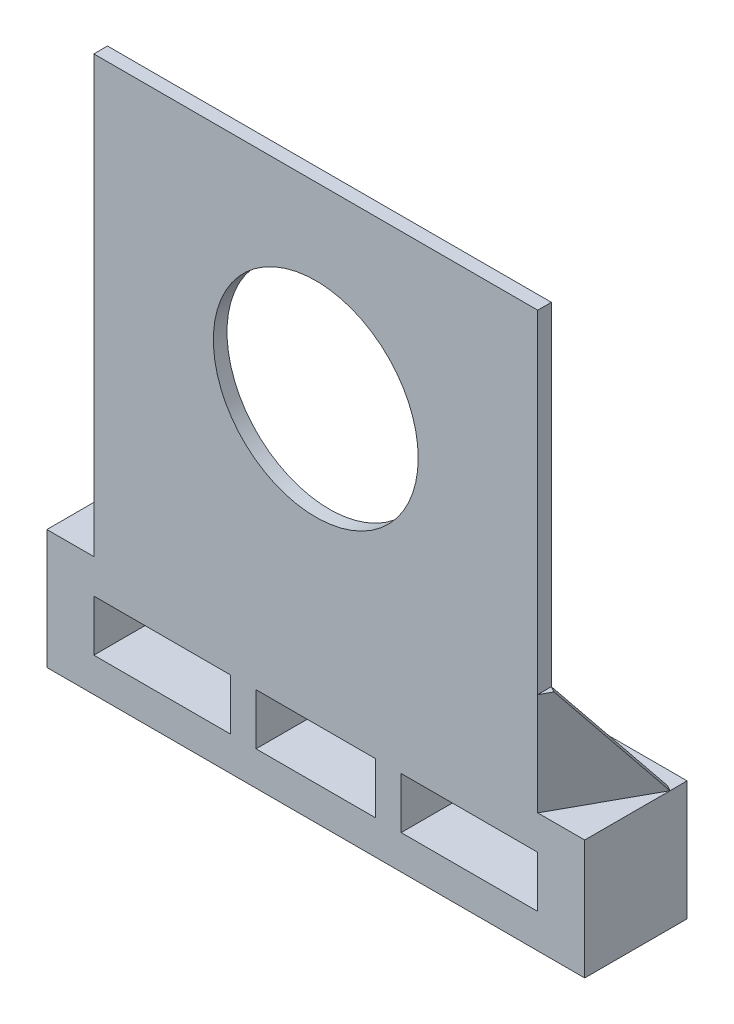
ISO-10303-21;
HEADER;
FILE_DESCRIPTION(('STEP AP214'),'2;1');
FILE_NAME('part.step','',(''),(''),'','','');
FILE_SCHEMA(('AUTOMOTIVE_DESIGN { 1 0 10303 214 1 1 1 1 }'));
ENDSEC;
DATA;
#1=APPLICATION_CONTEXT('core data for automotive mechanical design processes');
#2=APPLICATION_PROTOCOL_DEFINITION('international standard','automotive_design',2000,#1);
#3=PRODUCT_CONTEXT('',#1,'mechanical');
#4=PRODUCT('Part','Part','',(#3));
#5=PRODUCT_RELATED_PRODUCT_CATEGORY('part','',(#4));
#6=PRODUCT_DEFINITION_FORMATION('','',#4);
#7=PRODUCT_DEFINITION_CONTEXT('part definition',#1,'design');
#8=PRODUCT_DEFINITION('design','',#6,#7);
#9=PRODUCT_DEFINITION_SHAPE('','',#8);
#10=(LENGTH_UNIT() NAMED_UNIT(*) SI_UNIT(.MILLI.,.METRE.));
#11=(NAMED_UNIT(*) PLANE_ANGLE_UNIT() SI_UNIT($,.RADIAN.));
#12=(NAMED_UNIT(*) SI_UNIT($,.STERADIAN.) SOLID_ANGLE_UNIT());
#13=UNCERTAINTY_MEASURE_WITH_UNIT(LENGTH_MEASURE(1.E-05),#10,'distance_accuracy_value','');
#14=(GEOMETRIC_REPRESENTATION_CONTEXT(3) GLOBAL_UNCERTAINTY_ASSIGNED_CONTEXT((#13)) GLOBAL_UNIT_ASSIGNED_CONTEXT((#10,
#11,#12)) REPRESENTATION_CONTEXT('',''));
#15=CARTESIAN_POINT('',(0.,0.,0.));
#16=DIRECTION('',(0.,0.,1.));
#17=DIRECTION('',(1.,0.,0.));
#18=AXIS2_PLACEMENT_3D('',#15,#16,#17);
#19=CARTESIAN_POINT('',(287.5,0.,-52.));
#20=DIRECTION('',(0.,1.,0.));
#21=DIRECTION('',(-1.,0.,0.));
#22=AXIS2_PLACEMENT_3D('',#19,#20,#21);
#23=PLANE('',#22);
#24=DIRECTION('',(-0.87621590867665,0.,0.48191874977215));
#25=VECTOR('',#24,1.);
#26=CARTESIAN_POINT('',(-27.4999999999996,0.,-42.));
#27=LINE('',#26,#25);
#28=CARTESIAN_POINT('',(-24.1218809980803,0.,-43.8579654510556));
#29=VERTEX_POINT('',#28);
#30=CARTESIAN_POINT('',(-27.4999999999996,0.,-42.));
#31=VERTEX_POINT('',#30);
#32=EDGE_CURVE('E206',#29,#31,#27,.T.);
#33=ORIENTED_EDGE('',*,*,#32,.F.);
#34=DIRECTION('',(-0.481918749772151,0.,-0.87621590867665));
#35=VECTOR('',#34,1.);
#36=CARTESIAN_POINT('',(-24.1218809980803,0.,-43.8579654510556));
#37=LINE('',#36,#35);
#38=CARTESIAN_POINT('',(0.,0.,0.));
#39=VERTEX_POINT('',#38);
#40=EDGE_CURVE('E212',#39,#29,#37,.T.);
#41=ORIENTED_EDGE('',*,*,#40,.F.);
#42=DIRECTION('',(1.,0.,0.));
#43=VECTOR('',#42,1.);
#44=CARTESIAN_POINT('',(260.,0.,0.));
#45=LINE('',#44,#43);
#46=CARTESIAN_POINT('',(260.,0.,0.));
#47=VERTEX_POINT('',#46);
#48=EDGE_CURVE('E393',#39,#47,#45,.T.);
#49=ORIENTED_EDGE('',*,*,#48,.T.);
#50=DIRECTION('',(-0.48191874977216,0.,0.876215908676645));
#51=VECTOR('',#50,1.);
#52=CARTESIAN_POINT('',(284.121880998081,0.,-43.8579654510557));
#53=LINE('',#52,#51);
#54=CARTESIAN_POINT('',(284.121880998081,0.,-43.8579654510557));
#55=VERTEX_POINT('',#54);
#56=EDGE_CURVE('E237',#55,#47,#53,.T.);
#57=ORIENTED_EDGE('',*,*,#56,.F.);
#58=DIRECTION('',(-0.876215908676644,0.,-0.481918749772161));
#59=VECTOR('',#58,1.);
#60=CARTESIAN_POINT('',(287.5,0.,-42.));
#61=LINE('',#60,#59);
#62=CARTESIAN_POINT('',(287.5,0.,-42.));
#63=VERTEX_POINT('',#62);
#64=EDGE_CURVE('E241',#63,#55,#61,.T.);
#65=ORIENTED_EDGE('',*,*,#64,.F.);
#66=DIRECTION('',(0.,0.,1.));
#67=VECTOR('',#66,1.);
#68=CARTESIAN_POINT('',(287.5,0.,-52.));
#69=LINE('',#68,#67);
#70=CARTESIAN_POINT('',(287.5,0.,-52.));
#71=VERTEX_POINT('',#70);
#72=EDGE_CURVE('E371',#71,#63,#69,.T.);
#73=ORIENTED_EDGE('',*,*,#72,.F.);
#74=DIRECTION('',(-1.,0.,0.));
#75=VECTOR('',#74,1.);
#76=CARTESIAN_POINT('',(287.5,0.,-52.));
#77=LINE('',#76,#75);
#78=CARTESIAN_POINT('',(-27.4999999999996,0.,-52.));
#79=VERTEX_POINT('',#78);
#80=EDGE_CURVE('E347',#71,#79,#77,.T.);
#81=ORIENTED_EDGE('',*,*,#80,.T.);
#82=DIRECTION('',(0.,0.,1.));
#83=VECTOR('',#82,1.);
#84=CARTESIAN_POINT('',(-27.4999999999996,0.,-52.));
#85=LINE('',#84,#83);
#86=EDGE_CURVE('E223',#79,#31,#85,.T.);
#87=ORIENTED_EDGE('',*,*,#86,.T.);
#88=EDGE_LOOP('',(#33,#41,#49,#57,#65,#73,#81,#87));
#89=FACE_BOUND('',#88,.T.);
#90=ADVANCED_FACE('F34',(#89),#23,.T.);
#91=DIRECTION('',(-1.,0.,0.));
#92=VECTOR('',#91,1.);
#93=CARTESIAN_POINT('',(287.5,0.,8.));
#94=LINE('',#93,#92);
#95=CARTESIAN_POINT('',(0.,0.,8.));
#96=VERTEX_POINT('',#95);
#97=CARTESIAN_POINT('',(-27.4999999999996,0.,8.));
#98=VERTEX_POINT('',#97);
#99=EDGE_CURVE('E358',#96,#98,#94,.T.);
#100=ORIENTED_EDGE('',*,*,#99,.F.);
#101=DIRECTION('',(0.481918749772151,0.,0.87621590867665));
#102=VECTOR('',#101,1.);
#103=CARTESIAN_POINT('',(0.,0.,8.));
#104=LINE('',#103,#102);
#105=EDGE_CURVE('E224',#31,#96,#104,.T.);
#106=ORIENTED_EDGE('',*,*,#105,.F.);
#107=EDGE_CURVE('E374',#31,#98,#85,.T.);
#108=ORIENTED_EDGE('',*,*,#107,.T.);
#109=EDGE_LOOP('',(#100,#106,#108));
#110=FACE_BOUND('',#109,.T.);
#111=ADVANCED_FACE('F484',(#110),#23,.T.);
#112=CARTESIAN_POINT('',(287.5,0.,8.));
#113=VERTEX_POINT('',#112);
#114=EDGE_CURVE('E370',#63,#113,#69,.T.);
#115=ORIENTED_EDGE('',*,*,#114,.F.);
#116=DIRECTION('',(0.481918749772161,0.,-0.876215908676644));
#117=VECTOR('',#116,1.);
#118=CARTESIAN_POINT('',(260.,0.,8.));
#119=LINE('',#118,#117);
#120=CARTESIAN_POINT('',(260.,0.,8.));
#121=VERTEX_POINT('',#120);
#122=EDGE_CURVE('E231',#121,#63,#119,.T.);
#123=ORIENTED_EDGE('',*,*,#122,.F.);
#124=EDGE_CURVE('E366',#113,#121,#94,.T.);
#125=ORIENTED_EDGE('',*,*,#124,.F.);
#126=EDGE_LOOP('',(#115,#123,#125));
#127=FACE_BOUND('',#126,.T.);
#128=ADVANCED_FACE('F470',(#127),#23,.T.);
#129=CARTESIAN_POINT('',(0.,0.,8.));
#130=DIRECTION('',(0.,0.,-1.));
#131=DIRECTION('',(-1.,0.,0.));
#132=AXIS2_PLACEMENT_3D('',#129,#130,#131);
#133=PLANE('',#132);
#134=DIRECTION('',(0.,-1.,0.));
#135=VECTOR('',#134,1.);
#136=CARTESIAN_POINT('',(0.,255.,8.));
#137=LINE('',#136,#135);
#138=CARTESIAN_POINT('',(0.,255.,8.));
#139=VERTEX_POINT('',#138);
#140=CARTESIAN_POINT('',(0.,60.,8.));
#141=VERTEX_POINT('',#140);
#142=EDGE_CURVE('E401',#139,#141,#137,.T.);
#143=ORIENTED_EDGE('',*,*,#142,.T.);
#144=DIRECTION('',(0.,-1.,0.));
#145=VECTOR('',#144,1.);
#146=CARTESIAN_POINT('',(0.,60.,8.));
#147=LINE('',#146,#145);
#148=EDGE_CURVE('E232',#141,#96,#147,.T.);
#149=ORIENTED_EDGE('',*,*,#148,.T.);
#150=ORIENTED_EDGE('',*,*,#99,.T.);
#151=DIRECTION('',(0.,-1.,0.));
#152=VECTOR('',#151,1.);
#153=CARTESIAN_POINT('',(-27.4999999999996,0.,8.));
#154=LINE('',#153,#152);
#155=CARTESIAN_POINT('',(-27.4999999999996,-70.,8.));
#156=VERTEX_POINT('',#155);
#157=EDGE_CURVE('E344',#98,#156,#154,.T.);
#158=ORIENTED_EDGE('',*,*,#157,.T.);
#159=DIRECTION('',(1.,0.,0.));
#160=VECTOR('',#159,1.);
#161=CARTESIAN_POINT('',(-27.4999999999996,-70.,8.));
#162=LINE('',#161,#160);
#163=CARTESIAN_POINT('',(287.5,-69.9999999999999,8.));
#164=VERTEX_POINT('',#163);
#165=EDGE_CURVE('E333',#156,#164,#162,.T.);
#166=ORIENTED_EDGE('',*,*,#165,.T.);
#167=DIRECTION('',(0.,1.,0.));
#168=VECTOR('',#167,1.);
#169=CARTESIAN_POINT('',(287.5,-69.9999999999999,8.));
#170=LINE('',#169,#168);
#171=EDGE_CURVE('E355',#164,#113,#170,.T.);
#172=ORIENTED_EDGE('',*,*,#171,.T.);
#173=ORIENTED_EDGE('',*,*,#124,.T.);
#174=DIRECTION('',(0.,1.,0.));
#175=VECTOR('',#174,1.);
#176=CARTESIAN_POINT('',(260.,0.,8.));
#177=LINE('',#176,#175);
#178=CARTESIAN_POINT('',(260.,60.,8.));
#179=VERTEX_POINT('',#178);
#180=EDGE_CURVE('E390',#121,#179,#177,.T.);
#181=ORIENTED_EDGE('',*,*,#180,.T.);
#182=CARTESIAN_POINT('',(260.,255.,8.));
#183=VERTEX_POINT('',#182);
#184=EDGE_CURVE('E406',#179,#183,#177,.T.);
#185=ORIENTED_EDGE('',*,*,#184,.T.);
#186=DIRECTION('',(-1.,0.,0.));
#187=VECTOR('',#186,1.);
#188=CARTESIAN_POINT('',(260.,255.,8.));
#189=LINE('',#188,#187);
#190=EDGE_CURVE('E388',#183,#139,#189,.T.);
#191=ORIENTED_EDGE('',*,*,#190,.T.);
#192=EDGE_LOOP('',(#143,#149,#150,#158,#166,#172,#173,#181,#185,#191));
#193=FACE_BOUND('',#192,.T.);
#194=CARTESIAN_POINT('',(130.,145.,8.));
#195=DIRECTION('',(0.,0.,1.));
#196=DIRECTION('',(1.,0.,0.));
#197=AXIS2_PLACEMENT_3D('',#194,#195,#196);
#198=CIRCLE('',#197,60.);
#199=CARTESIAN_POINT('',(190.,145.,8.));
#200=VERTEX_POINT('',#199);
#201=EDGE_CURVE('E381',#200,#200,#198,.T.);
#202=ORIENTED_EDGE('',*,*,#201,.F.);
#203=EDGE_LOOP('',(#202));
#204=FACE_BOUND('',#203,.T.);
#205=DIRECTION('',(-1.,0.,0.));
#206=VECTOR('',#205,1.);
#207=CARTESIAN_POINT('',(0.,-20.,8.));
#208=LINE('',#207,#206);
#209=CARTESIAN_POINT('',(79.9999999999999,-20.,8.));
#210=VERTEX_POINT('',#209);
#211=CARTESIAN_POINT('',(-1.11022302462516E-13,-20.,8.));
#212=VERTEX_POINT('',#211);
#213=EDGE_CURVE('E240',#210,#212,#208,.T.);
#214=ORIENTED_EDGE('',*,*,#213,.F.);
#215=DIRECTION('',(0.,1.,0.));
#216=VECTOR('',#215,1.);
#217=CARTESIAN_POINT('',(79.9999999999999,-20.,8.));
#218=LINE('',#217,#216);
#219=CARTESIAN_POINT('',(79.9999999999999,-50.,8.));
#220=VERTEX_POINT('',#219);
#221=EDGE_CURVE('E248',#220,#210,#218,.T.);
#222=ORIENTED_EDGE('',*,*,#221,.F.);
#223=DIRECTION('',(1.,0.,0.));
#224=VECTOR('',#223,1.);
#225=CARTESIAN_POINT('',(0.,-50.,8.));
#226=LINE('',#225,#224);
#227=CARTESIAN_POINT('',(0.,-50.,8.));
#228=VERTEX_POINT('',#227);
#229=EDGE_CURVE('E262',#228,#220,#226,.T.);
#230=ORIENTED_EDGE('',*,*,#229,.F.);
#231=DIRECTION('',(0.,-1.,0.));
#232=VECTOR('',#231,1.);
#233=CARTESIAN_POINT('',(0.,-20.,8.));
#234=LINE('',#233,#232);
#235=EDGE_CURVE('E259',#212,#228,#234,.T.);
#236=ORIENTED_EDGE('',*,*,#235,.F.);
#237=EDGE_LOOP('',(#214,#222,#230,#236));
#238=FACE_BOUND('',#237,.T.);
#239=DIRECTION('',(-1.,0.,0.));
#240=VECTOR('',#239,1.);
#241=CARTESIAN_POINT('',(95.,-20.,8.));
#242=LINE('',#241,#240);
#243=CARTESIAN_POINT('',(165.,-20.,8.));
#244=VERTEX_POINT('',#243);
#245=CARTESIAN_POINT('',(95.,-20.,8.));
#246=VERTEX_POINT('',#245);
#247=EDGE_CURVE('E269',#244,#246,#242,.T.);
#248=ORIENTED_EDGE('',*,*,#247,.F.);
#249=DIRECTION('',(0.,1.,0.));
#250=VECTOR('',#249,1.);
#251=CARTESIAN_POINT('',(165.,-20.,8.));
#252=LINE('',#251,#250);
#253=CARTESIAN_POINT('',(165.,-50.,8.));
#254=VERTEX_POINT('',#253);
#255=EDGE_CURVE('E280',#254,#244,#252,.T.);
#256=ORIENTED_EDGE('',*,*,#255,.F.);
#257=DIRECTION('',(1.,0.,0.));
#258=VECTOR('',#257,1.);
#259=CARTESIAN_POINT('',(94.9999999999999,-50.,8.));
#260=LINE('',#259,#258);
#261=CARTESIAN_POINT('',(94.9999999999999,-50.,8.));
#262=VERTEX_POINT('',#261);
#263=EDGE_CURVE('E294',#262,#254,#260,.T.);
#264=ORIENTED_EDGE('',*,*,#263,.F.);
#265=DIRECTION('',(0.,-1.,0.));
#266=VECTOR('',#265,1.);
#267=CARTESIAN_POINT('',(94.9999999999999,-50.,8.));
#268=LINE('',#267,#266);
#269=EDGE_CURVE('E291',#246,#262,#268,.T.);
#270=ORIENTED_EDGE('',*,*,#269,.F.);
#271=EDGE_LOOP('',(#248,#256,#264,#270));
#272=FACE_BOUND('',#271,.T.);
#273=DIRECTION('',(1.,0.,0.));
#274=VECTOR('',#273,1.);
#275=CARTESIAN_POINT('',(180.000000000001,-50.,8.));
#276=LINE('',#275,#274);
#277=CARTESIAN_POINT('',(180.000000000001,-50.,8.));
#278=VERTEX_POINT('',#277);
#279=CARTESIAN_POINT('',(260.,-50.,8.));
#280=VERTEX_POINT('',#279);
#281=EDGE_CURVE('E301',#278,#280,#276,.T.);
#282=ORIENTED_EDGE('',*,*,#281,.F.);
#283=DIRECTION('',(0.,-1.,0.));
#284=VECTOR('',#283,1.);
#285=CARTESIAN_POINT('',(180.000000000001,-50.,8.));
#286=LINE('',#285,#284);
#287=CARTESIAN_POINT('',(180.000000000001,-20.,8.));
#288=VERTEX_POINT('',#287);
#289=EDGE_CURVE('E312',#288,#278,#286,.T.);
#290=ORIENTED_EDGE('',*,*,#289,.F.);
#291=DIRECTION('',(-1.,0.,0.));
#292=VECTOR('',#291,1.);
#293=CARTESIAN_POINT('',(180.000000000001,-20.,8.));
#294=LINE('',#293,#292);
#295=CARTESIAN_POINT('',(260.,-20.,8.));
#296=VERTEX_POINT('',#295);
#297=EDGE_CURVE('E326',#296,#288,#294,.T.);
#298=ORIENTED_EDGE('',*,*,#297,.F.);
#299=DIRECTION('',(0.,1.,0.));
#300=VECTOR('',#299,1.);
#301=CARTESIAN_POINT('',(260.,-50.,8.));
#302=LINE('',#301,#300);
#303=EDGE_CURVE('E323',#280,#296,#302,.T.);
#304=ORIENTED_EDGE('',*,*,#303,.F.);
#305=EDGE_LOOP('',(#282,#290,#298,#304));
#306=FACE_BOUND('',#305,.T.);
#307=ADVANCED_FACE('F439',(#193,#204,#238,#272,#306),#133,.F.);
#308=CARTESIAN_POINT('',(0.,0.,0.));
#309=DIRECTION('',(0.,0.,-1.));
#310=DIRECTION('',(-1.,0.,0.));
#311=AXIS2_PLACEMENT_3D('',#308,#309,#310);
#312=PLANE('',#311);
#313=DIRECTION('',(0.,-1.,0.));
#314=VECTOR('',#313,1.);
#315=CARTESIAN_POINT('',(0.,255.,0.));
#316=LINE('',#315,#314);
#317=CARTESIAN_POINT('',(0.,255.,0.));
#318=VERTEX_POINT('',#317);
#319=CARTESIAN_POINT('',(0.,60.,0.));
#320=VERTEX_POINT('',#319);
#321=EDGE_CURVE('E386',#318,#320,#316,.T.);
#322=ORIENTED_EDGE('',*,*,#321,.F.);
#323=DIRECTION('',(-1.,0.,0.));
#324=VECTOR('',#323,1.);
#325=CARTESIAN_POINT('',(260.,255.,0.));
#326=LINE('',#325,#324);
#327=CARTESIAN_POINT('',(260.,255.,0.));
#328=VERTEX_POINT('',#327);
#329=EDGE_CURVE('E399',#328,#318,#326,.T.);
#330=ORIENTED_EDGE('',*,*,#329,.F.);
#331=DIRECTION('',(0.,1.,0.));
#332=VECTOR('',#331,1.);
#333=CARTESIAN_POINT('',(260.,0.,0.));
#334=LINE('',#333,#332);
#335=CARTESIAN_POINT('',(260.,60.,0.));
#336=VERTEX_POINT('',#335);
#337=EDGE_CURVE('E395',#336,#328,#334,.T.);
#338=ORIENTED_EDGE('',*,*,#337,.F.);
#339=EDGE_CURVE('E396',#47,#336,#334,.T.);
#340=ORIENTED_EDGE('',*,*,#339,.F.);
#341=ORIENTED_EDGE('',*,*,#48,.F.);
#342=DIRECTION('',(0.,-1.,0.));
#343=VECTOR('',#342,1.);
#344=CARTESIAN_POINT('',(0.,60.,0.));
#345=LINE('',#344,#343);
#346=EDGE_CURVE('E215',#320,#39,#345,.T.);
#347=ORIENTED_EDGE('',*,*,#346,.F.);
#348=EDGE_LOOP('',(#322,#330,#338,#340,#341,#347));
#349=FACE_BOUND('',#348,.T.);
#350=CARTESIAN_POINT('',(130.,145.,0.));
#351=DIRECTION('',(0.,0.,1.));
#352=DIRECTION('',(1.,0.,0.));
#353=AXIS2_PLACEMENT_3D('',#350,#351,#352);
#354=CIRCLE('',#353,60.);
#355=CARTESIAN_POINT('',(190.,145.,0.));
#356=VERTEX_POINT('',#355);
#357=EDGE_CURVE('E376',#356,#356,#354,.T.);
#358=ORIENTED_EDGE('',*,*,#357,.T.);
#359=EDGE_LOOP('',(#358));
#360=FACE_BOUND('',#359,.T.);
#361=ADVANCED_FACE('F449',(#349,#360),#312,.T.);
#362=CARTESIAN_POINT('',(0.,255.,8.));
#363=DIRECTION('',(1.,0.,0.));
#364=DIRECTION('',(0.,1.,0.));
#365=AXIS2_PLACEMENT_3D('',#362,#363,#364);
#366=PLANE('',#365);
#367=ORIENTED_EDGE('',*,*,#321,.T.);
#368=DIRECTION('',(0.,0.,-1.));
#369=VECTOR('',#368,1.);
#370=CARTESIAN_POINT('',(0.,60.,0.));
#371=LINE('',#370,#369);
#372=EDGE_CURVE('E226',#141,#320,#371,.T.);
#373=ORIENTED_EDGE('',*,*,#372,.F.);
#374=ORIENTED_EDGE('',*,*,#142,.F.);
#375=DIRECTION('',(0.,0.,-1.));
#376=VECTOR('',#375,1.);
#377=CARTESIAN_POINT('',(0.,255.,8.));
#378=LINE('',#377,#376);
#379=EDGE_CURVE('E43',#139,#318,#378,.T.);
#380=ORIENTED_EDGE('',*,*,#379,.T.);
#381=EDGE_LOOP('',(#367,#373,#374,#380));
#382=FACE_BOUND('',#381,.T.);
#383=ADVANCED_FACE('F36',(#382),#366,.F.);
#384=CARTESIAN_POINT('',(260.,0.,8.));
#385=DIRECTION('',(-1.,0.,0.));
#386=DIRECTION('',(0.,0.,1.));
#387=AXIS2_PLACEMENT_3D('',#384,#385,#386);
#388=PLANE('',#387);
#389=ORIENTED_EDGE('',*,*,#184,.F.);
#390=DIRECTION('',(0.,0.,1.));
#391=VECTOR('',#390,1.);
#392=CARTESIAN_POINT('',(260.,60.,8.));
#393=LINE('',#392,#391);
#394=EDGE_CURVE('E233',#336,#179,#393,.T.);
#395=ORIENTED_EDGE('',*,*,#394,.F.);
#396=ORIENTED_EDGE('',*,*,#337,.T.);
#397=DIRECTION('',(0.,0.,-1.));
#398=VECTOR('',#397,1.);
#399=CARTESIAN_POINT('',(260.,255.,8.));
#400=LINE('',#399,#398);
#401=EDGE_CURVE('E11',#183,#328,#400,.T.);
#402=ORIENTED_EDGE('',*,*,#401,.F.);
#403=EDGE_LOOP('',(#389,#395,#396,#402));
#404=FACE_BOUND('',#403,.T.);
#405=ADVANCED_FACE('F509',(#404),#388,.F.);
#406=CARTESIAN_POINT('',(260.,255.,8.));
#407=DIRECTION('',(0.,-1.,0.));
#408=DIRECTION('',(1.,0.,0.));
#409=AXIS2_PLACEMENT_3D('',#406,#407,#408);
#410=PLANE('',#409);
#411=ORIENTED_EDGE('',*,*,#329,.T.);
#412=ORIENTED_EDGE('',*,*,#379,.F.);
#413=ORIENTED_EDGE('',*,*,#190,.F.);
#414=ORIENTED_EDGE('',*,*,#401,.T.);
#415=EDGE_LOOP('',(#411,#412,#413,#414));
#416=FACE_BOUND('',#415,.T.);
#417=ADVANCED_FACE('F446',(#416),#410,.F.);
#418=CARTESIAN_POINT('',(130.,145.,8.));
#419=DIRECTION('',(0.,0.,-1.));
#420=DIRECTION('',(-1.,0.,0.));
#421=AXIS2_PLACEMENT_3D('',#418,#419,#420);
#422=CYLINDRICAL_SURFACE('',#421,60.);
#423=ORIENTED_EDGE('',*,*,#201,.T.);
#424=EDGE_LOOP('',(#423));
#425=FACE_BOUND('',#424,.T.);
#426=ORIENTED_EDGE('',*,*,#357,.F.);
#427=EDGE_LOOP('',(#426));
#428=FACE_BOUND('',#427,.T.);
#429=ADVANCED_FACE('F499',(#425,#428),#422,.F.);
#430=CARTESIAN_POINT('',(-27.4999999999996,-70.,-52.));
#431=DIRECTION('',(0.,-1.,0.));
#432=DIRECTION('',(1.,0.,0.));
#433=AXIS2_PLACEMENT_3D('',#430,#431,#432);
#434=PLANE('',#433);
#435=ORIENTED_EDGE('',*,*,#165,.F.);
#436=DIRECTION('',(0.,0.,1.));
#437=VECTOR('',#436,1.);
#438=CARTESIAN_POINT('',(-27.4999999999996,-70.,-52.));
#439=LINE('',#438,#437);
#440=CARTESIAN_POINT('',(-27.4999999999996,-70.,-52.));
#441=VERTEX_POINT('',#440);
#442=EDGE_CURVE('E375',#441,#156,#439,.T.);
#443=ORIENTED_EDGE('',*,*,#442,.F.);
#444=DIRECTION('',(1.,0.,0.));
#445=VECTOR('',#444,1.);
#446=CARTESIAN_POINT('',(-27.4999999999996,-70.,-52.));
#447=LINE('',#446,#445);
#448=CARTESIAN_POINT('',(287.5,-69.9999999999999,-52.));
#449=VERTEX_POINT('',#448);
#450=EDGE_CURVE('E340',#441,#449,#447,.T.);
#451=ORIENTED_EDGE('',*,*,#450,.T.);
#452=DIRECTION('',(0.,0.,1.));
#453=VECTOR('',#452,1.);
#454=CARTESIAN_POINT('',(287.5,-69.9999999999999,-52.));
#455=LINE('',#454,#453);
#456=EDGE_CURVE('E352',#449,#164,#455,.T.);
#457=ORIENTED_EDGE('',*,*,#456,.T.);
#458=EDGE_LOOP('',(#435,#443,#451,#457));
#459=FACE_BOUND('',#458,.T.);
#460=ADVANCED_FACE('F496',(#459),#434,.T.);
#461=CARTESIAN_POINT('',(-27.4999999999996,0.,-52.));
#462=DIRECTION('',(-1.,0.,0.));
#463=DIRECTION('',(0.,0.,1.));
#464=AXIS2_PLACEMENT_3D('',#461,#462,#463);
#465=PLANE('',#464);
#466=ORIENTED_EDGE('',*,*,#157,.F.);
#467=ORIENTED_EDGE('',*,*,#107,.F.);
#468=ORIENTED_EDGE('',*,*,#86,.F.);
#469=DIRECTION('',(0.,-1.,0.));
#470=VECTOR('',#469,1.);
#471=CARTESIAN_POINT('',(-27.4999999999996,0.,-52.));
#472=LINE('',#471,#470);
#473=EDGE_CURVE('E349',#79,#441,#472,.T.);
#474=ORIENTED_EDGE('',*,*,#473,.T.);
#475=ORIENTED_EDGE('',*,*,#442,.T.);
#476=EDGE_LOOP('',(#466,#467,#468,#474,#475));
#477=FACE_BOUND('',#476,.T.);
#478=ADVANCED_FACE('F481',(#477),#465,.T.);
#479=CARTESIAN_POINT('',(287.5,-69.9999999999999,-52.));
#480=DIRECTION('',(1.,0.,0.));
#481=DIRECTION('',(0.,1.,0.));
#482=AXIS2_PLACEMENT_3D('',#479,#480,#481);
#483=PLANE('',#482);
#484=ORIENTED_EDGE('',*,*,#171,.F.);
#485=ORIENTED_EDGE('',*,*,#456,.F.);
#486=DIRECTION('',(0.,1.,0.));
#487=VECTOR('',#486,1.);
#488=CARTESIAN_POINT('',(287.5,-69.9999999999999,-52.));
#489=LINE('',#488,#487);
#490=EDGE_CURVE('E343',#449,#71,#489,.T.);
#491=ORIENTED_EDGE('',*,*,#490,.T.);
#492=ORIENTED_EDGE('',*,*,#72,.T.);
#493=ORIENTED_EDGE('',*,*,#114,.T.);
#494=EDGE_LOOP('',(#484,#485,#491,#492,#493));
#495=FACE_BOUND('',#494,.T.);
#496=ADVANCED_FACE('F474',(#495),#483,.T.);
#497=CARTESIAN_POINT('',(287.5,-69.9999999999999,-52.));
#498=DIRECTION('',(0.,0.,1.));
#499=DIRECTION('',(1.,0.,0.));
#500=AXIS2_PLACEMENT_3D('',#497,#498,#499);
#501=PLANE('',#500);
#502=DIRECTION('',(0.,1.,0.));
#503=VECTOR('',#502,1.);
#504=CARTESIAN_POINT('',(79.9999999999999,-20.,-52.));
#505=LINE('',#504,#503);
#506=CARTESIAN_POINT('',(79.9999999999999,-50.,-52.));
#507=VERTEX_POINT('',#506);
#508=CARTESIAN_POINT('',(79.9999999999999,-20.,-52.));
#509=VERTEX_POINT('',#508);
#510=EDGE_CURVE('E254',#507,#509,#505,.T.);
#511=ORIENTED_EDGE('',*,*,#510,.T.);
#512=DIRECTION('',(-1.,0.,0.));
#513=VECTOR('',#512,1.);
#514=CARTESIAN_POINT('',(0.,-20.,-52.));
#515=LINE('',#514,#513);
#516=CARTESIAN_POINT('',(0.,-20.,-52.));
#517=VERTEX_POINT('',#516);
#518=EDGE_CURVE('E244',#509,#517,#515,.T.);
#519=ORIENTED_EDGE('',*,*,#518,.T.);
#520=DIRECTION('',(0.,-1.,0.));
#521=VECTOR('',#520,1.);
#522=CARTESIAN_POINT('',(0.,-20.,-52.));
#523=LINE('',#522,#521);
#524=CARTESIAN_POINT('',(-1.11022302462516E-13,-50.,-52.));
#525=VERTEX_POINT('',#524);
#526=EDGE_CURVE('E247',#517,#525,#523,.T.);
#527=ORIENTED_EDGE('',*,*,#526,.T.);
#528=DIRECTION('',(1.,0.,0.));
#529=VECTOR('',#528,1.);
#530=CARTESIAN_POINT('',(0.,-50.,-52.));
#531=LINE('',#530,#529);
#532=EDGE_CURVE('E251',#525,#507,#531,.T.);
#533=ORIENTED_EDGE('',*,*,#532,.T.);
#534=EDGE_LOOP('',(#511,#519,#527,#533));
#535=FACE_BOUND('',#534,.T.);
#536=DIRECTION('',(0.,1.,0.));
#537=VECTOR('',#536,1.);
#538=CARTESIAN_POINT('',(165.,-20.,-52.));
#539=LINE('',#538,#537);
#540=CARTESIAN_POINT('',(165.,-50.,-52.));
#541=VERTEX_POINT('',#540);
#542=CARTESIAN_POINT('',(165.,-20.,-52.));
#543=VERTEX_POINT('',#542);
#544=EDGE_CURVE('E286',#541,#543,#539,.T.);
#545=ORIENTED_EDGE('',*,*,#544,.T.);
#546=DIRECTION('',(-1.,0.,0.));
#547=VECTOR('',#546,1.);
#548=CARTESIAN_POINT('',(95.,-20.,-52.));
#549=LINE('',#548,#547);
#550=CARTESIAN_POINT('',(95.,-20.,-52.));
#551=VERTEX_POINT('',#550);
#552=EDGE_CURVE('E276',#543,#551,#549,.T.);
#553=ORIENTED_EDGE('',*,*,#552,.T.);
#554=DIRECTION('',(0.,-1.,0.));
#555=VECTOR('',#554,1.);
#556=CARTESIAN_POINT('',(94.9999999999999,-50.,-52.));
#557=LINE('',#556,#555);
#558=CARTESIAN_POINT('',(94.9999999999999,-50.,-52.));
#559=VERTEX_POINT('',#558);
#560=EDGE_CURVE('E279',#551,#559,#557,.T.);
#561=ORIENTED_EDGE('',*,*,#560,.T.);
#562=DIRECTION('',(1.,0.,0.));
#563=VECTOR('',#562,1.);
#564=CARTESIAN_POINT('',(94.9999999999999,-50.,-52.));
#565=LINE('',#564,#563);
#566=EDGE_CURVE('E283',#559,#541,#565,.T.);
#567=ORIENTED_EDGE('',*,*,#566,.T.);
#568=EDGE_LOOP('',(#545,#553,#561,#567));
#569=FACE_BOUND('',#568,.T.);
#570=DIRECTION('',(0.,-1.,0.));
#571=VECTOR('',#570,1.);
#572=CARTESIAN_POINT('',(180.000000000001,-50.,-52.));
#573=LINE('',#572,#571);
#574=CARTESIAN_POINT('',(180.000000000001,-20.,-52.));
#575=VERTEX_POINT('',#574);
#576=CARTESIAN_POINT('',(180.000000000001,-50.,-52.));
#577=VERTEX_POINT('',#576);
#578=EDGE_CURVE('E318',#575,#577,#573,.T.);
#579=ORIENTED_EDGE('',*,*,#578,.T.);
#580=DIRECTION('',(1.,0.,0.));
#581=VECTOR('',#580,1.);
#582=CARTESIAN_POINT('',(180.000000000001,-50.,-52.));
#583=LINE('',#582,#581);
#584=CARTESIAN_POINT('',(260.,-50.,-52.));
#585=VERTEX_POINT('',#584);
#586=EDGE_CURVE('E308',#577,#585,#583,.T.);
#587=ORIENTED_EDGE('',*,*,#586,.T.);
#588=DIRECTION('',(0.,1.,0.));
#589=VECTOR('',#588,1.);
#590=CARTESIAN_POINT('',(260.,-50.,-52.));
#591=LINE('',#590,#589);
#592=CARTESIAN_POINT('',(260.,-20.,-52.));
#593=VERTEX_POINT('',#592);
#594=EDGE_CURVE('E311',#585,#593,#591,.T.);
#595=ORIENTED_EDGE('',*,*,#594,.T.);
#596=DIRECTION('',(-1.,0.,0.));
#597=VECTOR('',#596,1.);
#598=CARTESIAN_POINT('',(180.000000000001,-20.,-52.));
#599=LINE('',#598,#597);
#600=EDGE_CURVE('E315',#593,#575,#599,.T.);
#601=ORIENTED_EDGE('',*,*,#600,.T.);
#602=EDGE_LOOP('',(#579,#587,#595,#601));
#603=FACE_BOUND('',#602,.T.);
#604=ORIENTED_EDGE('',*,*,#450,.F.);
#605=ORIENTED_EDGE('',*,*,#473,.F.);
#606=ORIENTED_EDGE('',*,*,#80,.F.);
#607=ORIENTED_EDGE('',*,*,#490,.F.);
#608=EDGE_LOOP('',(#604,#605,#606,#607));
#609=FACE_BOUND('',#608,.T.);
#610=ADVANCED_FACE('F480',(#535,#569,#603,#609),#501,.F.);
#611=CARTESIAN_POINT('',(180.000000000001,-50.,-52.));
#612=DIRECTION('',(0.,-1.,0.));
#613=DIRECTION('',(0.,0.,-1.));
#614=AXIS2_PLACEMENT_3D('',#611,#612,#613);
#615=PLANE('',#614);
#616=ORIENTED_EDGE('',*,*,#281,.T.);
#617=DIRECTION('',(0.,0.,1.));
#618=VECTOR('',#617,1.);
#619=CARTESIAN_POINT('',(260.,-50.,-52.));
#620=LINE('',#619,#618);
#621=EDGE_CURVE('E321',#585,#280,#620,.T.);
#622=ORIENTED_EDGE('',*,*,#621,.F.);
#623=ORIENTED_EDGE('',*,*,#586,.F.);
#624=DIRECTION('',(0.,0.,1.));
#625=VECTOR('',#624,1.);
#626=CARTESIAN_POINT('',(180.000000000001,-50.,-52.));
#627=LINE('',#626,#625);
#628=EDGE_CURVE('E331',#577,#278,#627,.T.);
#629=ORIENTED_EDGE('',*,*,#628,.T.);
#630=EDGE_LOOP('',(#616,#622,#623,#629));
#631=FACE_BOUND('',#630,.T.);
#632=ADVANCED_FACE('F660',(#631),#615,.F.);
#633=CARTESIAN_POINT('',(180.000000000001,-50.,-52.));
#634=DIRECTION('',(-1.,0.,0.));
#635=DIRECTION('',(0.,0.,1.));
#636=AXIS2_PLACEMENT_3D('',#633,#634,#635);
#637=PLANE('',#636);
#638=ORIENTED_EDGE('',*,*,#289,.T.);
#639=ORIENTED_EDGE('',*,*,#628,.F.);
#640=ORIENTED_EDGE('',*,*,#578,.F.);
#641=DIRECTION('',(0.,0.,1.));
#642=VECTOR('',#641,1.);
#643=CARTESIAN_POINT('',(180.000000000001,-20.,-52.));
#644=LINE('',#643,#642);
#645=EDGE_CURVE('E334',#575,#288,#644,.T.);
#646=ORIENTED_EDGE('',*,*,#645,.T.);
#647=EDGE_LOOP('',(#638,#639,#640,#646));
#648=FACE_BOUND('',#647,.T.);
#649=ADVANCED_FACE('F669',(#648),#637,.F.);
#650=CARTESIAN_POINT('',(180.000000000001,-20.,-52.));
#651=DIRECTION('',(0.,1.,0.));
#652=DIRECTION('',(0.,0.,1.));
#653=AXIS2_PLACEMENT_3D('',#650,#651,#652);
#654=PLANE('',#653);
#655=ORIENTED_EDGE('',*,*,#297,.T.);
#656=ORIENTED_EDGE('',*,*,#645,.F.);
#657=ORIENTED_EDGE('',*,*,#600,.F.);
#658=DIRECTION('',(0.,0.,1.));
#659=VECTOR('',#658,1.);
#660=CARTESIAN_POINT('',(260.,-20.,-52.));
#661=LINE('',#660,#659);
#662=EDGE_CURVE('E336',#593,#296,#661,.T.);
#663=ORIENTED_EDGE('',*,*,#662,.T.);
#664=EDGE_LOOP('',(#655,#656,#657,#663));
#665=FACE_BOUND('',#664,.T.);
#666=ADVANCED_FACE('F679',(#665),#654,.F.);
#667=CARTESIAN_POINT('',(260.,-50.,-52.));
#668=DIRECTION('',(1.,0.,0.));
#669=DIRECTION('',(0.,0.,-1.));
#670=AXIS2_PLACEMENT_3D('',#667,#668,#669);
#671=PLANE('',#670);
#672=ORIENTED_EDGE('',*,*,#303,.T.);
#673=ORIENTED_EDGE('',*,*,#662,.F.);
#674=ORIENTED_EDGE('',*,*,#594,.F.);
#675=ORIENTED_EDGE('',*,*,#621,.T.);
#676=EDGE_LOOP('',(#672,#673,#674,#675));
#677=FACE_BOUND('',#676,.T.);
#678=ADVANCED_FACE('F689',(#677),#671,.F.);
#679=CARTESIAN_POINT('',(95.,-20.,-52.));
#680=DIRECTION('',(0.,1.,0.));
#681=DIRECTION('',(0.,0.,1.));
#682=AXIS2_PLACEMENT_3D('',#679,#680,#681);
#683=PLANE('',#682);
#684=ORIENTED_EDGE('',*,*,#247,.T.);
#685=DIRECTION('',(0.,0.,1.));
#686=VECTOR('',#685,1.);
#687=CARTESIAN_POINT('',(95.,-20.,-52.));
#688=LINE('',#687,#686);
#689=EDGE_CURVE('E289',#551,#246,#688,.T.);
#690=ORIENTED_EDGE('',*,*,#689,.F.);
#691=ORIENTED_EDGE('',*,*,#552,.F.);
#692=DIRECTION('',(0.,0.,1.));
#693=VECTOR('',#692,1.);
#694=CARTESIAN_POINT('',(165.,-20.,-52.));
#695=LINE('',#694,#693);
#696=EDGE_CURVE('E299',#543,#244,#695,.T.);
#697=ORIENTED_EDGE('',*,*,#696,.T.);
#698=EDGE_LOOP('',(#684,#690,#691,#697));
#699=FACE_BOUND('',#698,.T.);
#700=ADVANCED_FACE('F699',(#699),#683,.F.);
#701=CARTESIAN_POINT('',(165.,-20.,-52.));
#702=DIRECTION('',(1.,0.,0.));
#703=DIRECTION('',(0.,1.,0.));
#704=AXIS2_PLACEMENT_3D('',#701,#702,#703);
#705=PLANE('',#704);
#706=ORIENTED_EDGE('',*,*,#255,.T.);
#707=ORIENTED_EDGE('',*,*,#696,.F.);
#708=ORIENTED_EDGE('',*,*,#544,.F.);
#709=DIRECTION('',(0.,0.,1.));
#710=VECTOR('',#709,1.);
#711=CARTESIAN_POINT('',(165.,-50.,-52.));
#712=LINE('',#711,#710);
#713=EDGE_CURVE('E302',#541,#254,#712,.T.);
#714=ORIENTED_EDGE('',*,*,#713,.T.);
#715=EDGE_LOOP('',(#706,#707,#708,#714));
#716=FACE_BOUND('',#715,.T.);
#717=ADVANCED_FACE('F709',(#716),#705,.F.);
#718=CARTESIAN_POINT('',(94.9999999999999,-50.,-52.));
#719=DIRECTION('',(0.,-1.,0.));
#720=DIRECTION('',(0.,0.,-1.));
#721=AXIS2_PLACEMENT_3D('',#718,#719,#720);
#722=PLANE('',#721);
#723=ORIENTED_EDGE('',*,*,#263,.T.);
#724=ORIENTED_EDGE('',*,*,#713,.F.);
#725=ORIENTED_EDGE('',*,*,#566,.F.);
#726=DIRECTION('',(0.,0.,1.));
#727=VECTOR('',#726,1.);
#728=CARTESIAN_POINT('',(94.9999999999999,-50.,-52.));
#729=LINE('',#728,#727);
#730=EDGE_CURVE('E304',#559,#262,#729,.T.);
#731=ORIENTED_EDGE('',*,*,#730,.T.);
#732=EDGE_LOOP('',(#723,#724,#725,#731));
#733=FACE_BOUND('',#732,.T.);
#734=ADVANCED_FACE('F719',(#733),#722,.F.);
#735=CARTESIAN_POINT('',(94.9999999999999,-50.,-52.));
#736=DIRECTION('',(-1.,0.,0.));
#737=DIRECTION('',(0.,-1.,0.));
#738=AXIS2_PLACEMENT_3D('',#735,#736,#737);
#739=PLANE('',#738);
#740=ORIENTED_EDGE('',*,*,#269,.T.);
#741=ORIENTED_EDGE('',*,*,#730,.F.);
#742=ORIENTED_EDGE('',*,*,#560,.F.);
#743=ORIENTED_EDGE('',*,*,#689,.T.);
#744=EDGE_LOOP('',(#740,#741,#742,#743));
#745=FACE_BOUND('',#744,.T.);
#746=ADVANCED_FACE('F729',(#745),#739,.F.);
#747=CARTESIAN_POINT('',(0.,-20.,-52.));
#748=DIRECTION('',(0.,1.,0.));
#749=DIRECTION('',(0.,0.,1.));
#750=AXIS2_PLACEMENT_3D('',#747,#748,#749);
#751=PLANE('',#750);
#752=ORIENTED_EDGE('',*,*,#213,.T.);
#753=DIRECTION('',(0.,0.,1.));
#754=VECTOR('',#753,1.);
#755=CARTESIAN_POINT('',(0.,-20.,-52.));
#756=LINE('',#755,#754);
#757=EDGE_CURVE('E257',#517,#212,#756,.T.);
#758=ORIENTED_EDGE('',*,*,#757,.F.);
#759=ORIENTED_EDGE('',*,*,#518,.F.);
#760=DIRECTION('',(0.,0.,1.));
#761=VECTOR('',#760,1.);
#762=CARTESIAN_POINT('',(79.9999999999999,-20.,-52.));
#763=LINE('',#762,#761);
#764=EDGE_CURVE('E267',#509,#210,#763,.T.);
#765=ORIENTED_EDGE('',*,*,#764,.T.);
#766=EDGE_LOOP('',(#752,#758,#759,#765));
#767=FACE_BOUND('',#766,.T.);
#768=ADVANCED_FACE('F739',(#767),#751,.F.);
#769=CARTESIAN_POINT('',(79.9999999999999,-20.,-52.));
#770=DIRECTION('',(1.,0.,0.));
#771=DIRECTION('',(0.,0.,-1.));
#772=AXIS2_PLACEMENT_3D('',#769,#770,#771);
#773=PLANE('',#772);
#774=ORIENTED_EDGE('',*,*,#221,.T.);
#775=ORIENTED_EDGE('',*,*,#764,.F.);
#776=ORIENTED_EDGE('',*,*,#510,.F.);
#777=DIRECTION('',(0.,0.,1.));
#778=VECTOR('',#777,1.);
#779=CARTESIAN_POINT('',(79.9999999999999,-50.,-52.));
#780=LINE('',#779,#778);
#781=EDGE_CURVE('E270',#507,#220,#780,.T.);
#782=ORIENTED_EDGE('',*,*,#781,.T.);
#783=EDGE_LOOP('',(#774,#775,#776,#782));
#784=FACE_BOUND('',#783,.T.);
#785=ADVANCED_FACE('F749',(#784),#773,.F.);
#786=CARTESIAN_POINT('',(0.,-50.,-52.));
#787=DIRECTION('',(0.,-1.,0.));
#788=DIRECTION('',(0.,0.,-1.));
#789=AXIS2_PLACEMENT_3D('',#786,#787,#788);
#790=PLANE('',#789);
#791=ORIENTED_EDGE('',*,*,#229,.T.);
#792=ORIENTED_EDGE('',*,*,#781,.F.);
#793=ORIENTED_EDGE('',*,*,#532,.F.);
#794=DIRECTION('',(0.,0.,1.));
#795=VECTOR('',#794,1.);
#796=CARTESIAN_POINT('',(0.,-50.,-52.));
#797=LINE('',#796,#795);
#798=EDGE_CURVE('E272',#525,#228,#797,.T.);
#799=ORIENTED_EDGE('',*,*,#798,.T.);
#800=EDGE_LOOP('',(#791,#792,#793,#799));
#801=FACE_BOUND('',#800,.T.);
#802=ADVANCED_FACE('F759',(#801),#790,.F.);
#803=CARTESIAN_POINT('',(0.,-20.,-52.));
#804=DIRECTION('',(-1.,0.,0.));
#805=DIRECTION('',(0.,0.,1.));
#806=AXIS2_PLACEMENT_3D('',#803,#804,#805);
#807=PLANE('',#806);
#808=ORIENTED_EDGE('',*,*,#235,.T.);
#809=ORIENTED_EDGE('',*,*,#798,.F.);
#810=ORIENTED_EDGE('',*,*,#526,.F.);
#811=ORIENTED_EDGE('',*,*,#757,.T.);
#812=EDGE_LOOP('',(#808,#809,#810,#811));
#813=FACE_BOUND('',#812,.T.);
#814=ADVANCED_FACE('F557',(#813),#807,.F.);
#815=CARTESIAN_POINT('',(260.,60.,8.));
#816=DIRECTION('',(-0.876215908676644,0.,-0.481918749772161));
#817=DIRECTION('',(-0.481918749772161,0.,0.876215908676644));
#818=AXIS2_PLACEMENT_3D('',#815,#816,#817);
#819=PLANE('',#818);
#820=ORIENTED_EDGE('',*,*,#122,.T.);
#821=DIRECTION('',(0.30871277209316,-0.767882335837043,-0.561295949260284));
#822=VECTOR('',#821,1.);
#823=CARTESIAN_POINT('',(287.5,0.,-42.));
#824=LINE('',#823,#822);
#825=CARTESIAN_POINT('',(263.378119001919,60.,1.85796545105572));
#826=VERTEX_POINT('',#825);
#827=EDGE_CURVE('E427',#826,#63,#824,.T.);
#828=ORIENTED_EDGE('',*,*,#827,.F.);
#829=DIRECTION('',(0.481918749772161,0.,-0.876215908676644));
#830=VECTOR('',#829,1.);
#831=CARTESIAN_POINT('',(260.,60.,8.));
#832=LINE('',#831,#830);
#833=EDGE_CURVE('E236',#179,#826,#832,.T.);
#834=ORIENTED_EDGE('',*,*,#833,.F.);
#835=ORIENTED_EDGE('',*,*,#180,.F.);
#836=EDGE_LOOP('',(#820,#828,#834,#835));
#837=FACE_BOUND('',#836,.T.);
#838=ADVANCED_FACE('F466',(#837),#819,.F.);
#839=CARTESIAN_POINT('',(284.121880998081,60.,-43.8579654510557));
#840=DIRECTION('',(0.876215908676644,0.,0.48191874977216));
#841=DIRECTION('',(0.48191874977216,0.,-0.876215908676645));
#842=AXIS2_PLACEMENT_3D('',#839,#840,#841);
#843=PLANE('',#842);
#844=ORIENTED_EDGE('',*,*,#339,.T.);
#845=DIRECTION('',(-0.30871277209316,0.767882335837043,0.561295949260284));
#846=VECTOR('',#845,1.);
#847=CARTESIAN_POINT('',(284.121880998081,0.,-43.8579654510557));
#848=LINE('',#847,#846);
#849=EDGE_CURVE('E209',#55,#336,#848,.T.);
#850=ORIENTED_EDGE('',*,*,#849,.F.);
#851=ORIENTED_EDGE('',*,*,#56,.T.);
#852=EDGE_LOOP('',(#844,#850,#851));
#853=FACE_BOUND('',#852,.T.);
#854=ADVANCED_FACE('F457',(#853),#843,.F.);
#855=CARTESIAN_POINT('',(260.,60.,-57.1250000000004));
#856=DIRECTION('',(0.,1.,0.));
#857=DIRECTION('',(-1.,0.,0.));
#858=AXIS2_PLACEMENT_3D('',#855,#856,#857);
#859=PLANE('',#858);
#860=DIRECTION('',(0.876215908676644,0.,0.481918749772161));
#861=VECTOR('',#860,1.);
#862=CARTESIAN_POINT('',(17.3116506717865,60.,-133.478592130519));
#863=LINE('',#862,#861);
#864=EDGE_CURVE('E219',#336,#826,#863,.T.);
#865=ORIENTED_EDGE('',*,*,#864,.F.);
#866=ORIENTED_EDGE('',*,*,#394,.T.);
#867=ORIENTED_EDGE('',*,*,#833,.T.);
#868=EDGE_LOOP('',(#865,#866,#867));
#869=FACE_BOUND('',#868,.T.);
#870=ADVANCED_FACE('F464',(#869),#859,.T.);
#871=CARTESIAN_POINT('',(-24.1218809980803,60.,-43.8579654510556));
#872=DIRECTION('',(-0.87621590867665,0.,0.481918749772151));
#873=DIRECTION('',(0.481918749772151,0.,0.87621590867665));
#874=AXIS2_PLACEMENT_3D('',#871,#872,#873);
#875=PLANE('',#874);
#876=ORIENTED_EDGE('',*,*,#40,.T.);
#877=DIRECTION('',(-0.308712772093152,-0.767882335837046,-0.561295949260284));
#878=VECTOR('',#877,1.);
#879=CARTESIAN_POINT('',(-24.1218809980803,0.,-43.8579654510556));
#880=LINE('',#879,#878);
#881=EDGE_CURVE('E202',#320,#29,#880,.T.);
#882=ORIENTED_EDGE('',*,*,#881,.F.);
#883=ORIENTED_EDGE('',*,*,#346,.T.);
#884=EDGE_LOOP('',(#876,#882,#883));
#885=FACE_BOUND('',#884,.T.);
#886=ADVANCED_FACE('F213',(#885),#875,.F.);
#887=CARTESIAN_POINT('',(0.,60.,8.));
#888=DIRECTION('',(0.87621590867665,0.,-0.481918749772151));
#889=DIRECTION('',(-0.481918749772151,0.,-0.87621590867665));
#890=AXIS2_PLACEMENT_3D('',#887,#888,#889);
#891=PLANE('',#890);
#892=DIRECTION('',(0.481918749772151,0.,0.87621590867665));
#893=VECTOR('',#892,1.);
#894=CARTESIAN_POINT('',(0.,60.,8.));
#895=LINE('',#894,#893);
#896=CARTESIAN_POINT('',(-3.37811900191936,60.,1.85796545105563));
#897=VERTEX_POINT('',#896);
#898=EDGE_CURVE('E58',#897,#141,#895,.T.);
#899=ORIENTED_EDGE('',*,*,#898,.F.);
#900=DIRECTION('',(0.308712772093152,0.767882335837046,0.561295949260284));
#901=VECTOR('',#900,1.);
#902=CARTESIAN_POINT('',(-27.4999999999996,0.,-42.));
#903=LINE('',#902,#901);
#904=EDGE_CURVE('E51',#31,#897,#903,.T.);
#905=ORIENTED_EDGE('',*,*,#904,.F.);
#906=ORIENTED_EDGE('',*,*,#105,.T.);
#907=ORIENTED_EDGE('',*,*,#148,.F.);
#908=EDGE_LOOP('',(#899,#905,#906,#907));
#909=FACE_BOUND('',#908,.T.);
#910=ADVANCED_FACE('F434',(#909),#891,.F.);
#911=CARTESIAN_POINT('',(0.,60.,-57.1249999999996));
#912=DIRECTION('',(0.,1.,0.));
#913=DIRECTION('',(-1.,0.,0.));
#914=AXIS2_PLACEMENT_3D('',#911,#912,#913);
#915=PLANE('',#914);
#916=DIRECTION('',(-0.87621590867665,0.,0.481918749772151));
#917=VECTOR('',#916,1.);
#918=CARTESIAN_POINT('',(242.688349328217,60.,-133.478592130517));
#919=LINE('',#918,#917);
#920=EDGE_CURVE('E207',#320,#897,#919,.T.);
#921=ORIENTED_EDGE('',*,*,#920,.T.);
#922=ORIENTED_EDGE('',*,*,#898,.T.);
#923=ORIENTED_EDGE('',*,*,#372,.T.);
#924=EDGE_LOOP('',(#921,#922,#923));
#925=FACE_BOUND('',#924,.T.);
#926=ADVANCED_FACE('F431',(#925),#915,.T.);
#927=CARTESIAN_POINT('',(41.4335316698674,0.,-177.336557581575));
#928=DIRECTION('',(-0.370056895258714,-0.640590913383453,0.672830718652199));
#929=DIRECTION('',(0.,-0.724245568700912,-0.689542135200665));
#930=AXIS2_PLACEMENT_3D('',#927,#928,#929);
#931=PLANE('',#930);
#932=ORIENTED_EDGE('',*,*,#849,.T.);
#933=ORIENTED_EDGE('',*,*,#864,.T.);
#934=ORIENTED_EDGE('',*,*,#827,.T.);
#935=ORIENTED_EDGE('',*,*,#64,.T.);
#936=EDGE_LOOP('',(#932,#933,#934,#935));
#937=FACE_BOUND('',#936,.T.);
#938=ADVANCED_FACE('F461',(#937),#931,.F.);
#939=CARTESIAN_POINT('',(218.566468330136,0.,-177.336557581573));
#940=DIRECTION('',(0.370056895258708,-0.64059091338345,0.672830718652206));
#941=DIRECTION('',(0.,-0.724245568700917,-0.68954213520066));
#942=AXIS2_PLACEMENT_3D('',#939,#940,#941);
#943=PLANE('',#942);
#944=ORIENTED_EDGE('',*,*,#881,.T.);
#945=ORIENTED_EDGE('',*,*,#32,.T.);
#946=ORIENTED_EDGE('',*,*,#904,.T.);
#947=ORIENTED_EDGE('',*,*,#920,.F.);
#948=EDGE_LOOP('',(#944,#945,#946,#947));
#949=FACE_BOUND('',#948,.T.);
#950=ADVANCED_FACE('F204',(#949),#943,.F.);
#951=CLOSED_SHELL('',(#90,#111,#128,#307,#361,#383,#405,#417,#429,#460,#478,#496,#610,#632,#649,
#666,#678,#700,#717,#734,#746,#768,#785,#802,#814,#838,#854,#870,#886,#910,#926,#938,#950));
#952=MANIFOLD_SOLID_BREP('B2',#951);
#953=ADVANCED_BREP_SHAPE_REPRESENTATION('',(#18,#952),#14);
#954=SHAPE_DEFINITION_REPRESENTATION(#9,#953);
ENDSEC;
END-ISO-10303-21;
